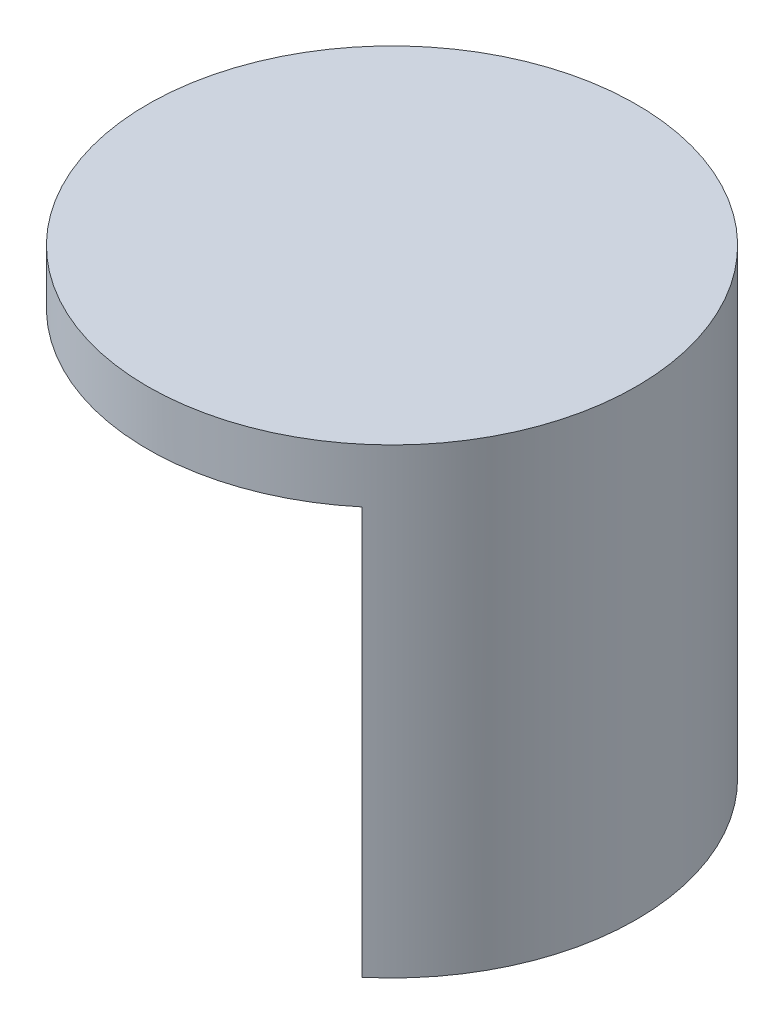
ISO-10303-21;
HEADER;
FILE_DESCRIPTION(('STEP AP214'),'2;1');
FILE_NAME('part.step','',(''),(''),'','','');
FILE_SCHEMA(('AUTOMOTIVE_DESIGN { 1 0 10303 214 1 1 1 1 }'));
ENDSEC;
DATA;
#1=APPLICATION_CONTEXT('core data for automotive mechanical design processes');
#2=APPLICATION_PROTOCOL_DEFINITION('international standard','automotive_design',2000,#1);
#3=PRODUCT_CONTEXT('',#1,'mechanical');
#4=PRODUCT('Part','Part','',(#3));
#5=PRODUCT_RELATED_PRODUCT_CATEGORY('part','',(#4));
#6=PRODUCT_DEFINITION_FORMATION('','',#4);
#7=PRODUCT_DEFINITION_CONTEXT('part definition',#1,'design');
#8=PRODUCT_DEFINITION('design','',#6,#7);
#9=PRODUCT_DEFINITION_SHAPE('','',#8);
#10=(LENGTH_UNIT() NAMED_UNIT(*) SI_UNIT(.MILLI.,.METRE.));
#11=(NAMED_UNIT(*) PLANE_ANGLE_UNIT() SI_UNIT($,.RADIAN.));
#12=(NAMED_UNIT(*) SI_UNIT($,.STERADIAN.) SOLID_ANGLE_UNIT());
#13=UNCERTAINTY_MEASURE_WITH_UNIT(LENGTH_MEASURE(1.E-05),#10,'distance_accuracy_value','');
#14=(GEOMETRIC_REPRESENTATION_CONTEXT(3) GLOBAL_UNCERTAINTY_ASSIGNED_CONTEXT((#13)) GLOBAL_UNIT_ASSIGNED_CONTEXT((#10,
#11,#12)) REPRESENTATION_CONTEXT('',''));
#15=CARTESIAN_POINT('',(0.,0.,0.));
#16=DIRECTION('',(0.,0.,1.));
#17=DIRECTION('',(1.,0.,0.));
#18=AXIS2_PLACEMENT_3D('',#15,#16,#17);
#19=CARTESIAN_POINT('',(0.,4.,0.));
#20=DIRECTION('',(0.,-1.,0.));
#21=DIRECTION('',(0.,0.,-1.));
#22=AXIS2_PLACEMENT_3D('',#19,#20,#21);
#23=CYLINDRICAL_SURFACE('',#22,18.);
#24=CARTESIAN_POINT('',(0.,4.,0.));
#25=DIRECTION('',(0.,1.,0.));
#26=DIRECTION('',(0.,0.,1.));
#27=AXIS2_PLACEMENT_3D('',#24,#25,#26);
#28=CIRCLE('',#27,18.);
#29=CARTESIAN_POINT('',(0.,4.,18.));
#30=VERTEX_POINT('',#29);
#31=EDGE_CURVE('E11',#30,#30,#28,.T.);
#32=ORIENTED_EDGE('',*,*,#31,.F.);
#33=EDGE_LOOP('',(#32));
#34=FACE_BOUND('',#33,.T.);
#35=CARTESIAN_POINT('',(0.,0.,0.));
#36=DIRECTION('',(0.,1.,0.));
#37=DIRECTION('',(0.,0.,1.));
#38=AXIS2_PLACEMENT_3D('',#35,#36,#37);
#39=CIRCLE('',#38,18.);
#40=CARTESIAN_POINT('',(11.5701769743577,0.,-13.7887999761416));
#41=VERTEX_POINT('',#40);
#42=CARTESIAN_POINT('',(11.5701769743577,0.,13.7887999761416));
#43=VERTEX_POINT('',#42);
#44=EDGE_CURVE('E40',#41,#43,#39,.T.);
#45=ORIENTED_EDGE('',*,*,#44,.T.);
#46=DIRECTION('',(0.,1.,0.));
#47=VECTOR('',#46,1.);
#48=CARTESIAN_POINT('',(11.5701769743577,-30.,13.7887999761416));
#49=LINE('',#48,#47);
#50=CARTESIAN_POINT('',(11.5701769743577,-30.,13.7887999761416));
#51=VERTEX_POINT('',#50);
#52=EDGE_CURVE('E105',#51,#43,#49,.T.);
#53=ORIENTED_EDGE('',*,*,#52,.F.);
#54=CARTESIAN_POINT('',(0.,-30.,0.));
#55=DIRECTION('',(0.,-1.,0.));
#56=DIRECTION('',(0.,0.,-1.));
#57=AXIS2_PLACEMENT_3D('',#54,#55,#56);
#58=CIRCLE('',#57,18.);
#59=CARTESIAN_POINT('',(11.5701769743577,-30.,-13.7887999761416));
#60=VERTEX_POINT('',#59);
#61=EDGE_CURVE('E90',#60,#51,#58,.T.);
#62=ORIENTED_EDGE('',*,*,#61,.F.);
#63=DIRECTION('',(0.,1.,0.));
#64=VECTOR('',#63,1.);
#65=CARTESIAN_POINT('',(11.5701769743577,-30.,-13.7887999761416));
#66=LINE('',#65,#64);
#67=EDGE_CURVE('E82',#60,#41,#66,.T.);
#68=ORIENTED_EDGE('',*,*,#67,.T.);
#69=EDGE_LOOP('',(#45,#53,#62,#68));
#70=FACE_BOUND('',#69,.T.);
#71=ADVANCED_FACE('F37',(#34,#70),#23,.T.);
#72=CARTESIAN_POINT('',(0.,4.,0.));
#73=DIRECTION('',(0.,1.,0.));
#74=DIRECTION('',(0.,0.,1.));
#75=AXIS2_PLACEMENT_3D('',#72,#73,#74);
#76=PLANE('',#75);
#77=ORIENTED_EDGE('',*,*,#31,.T.);
#78=EDGE_LOOP('',(#77));
#79=FACE_BOUND('',#78,.T.);
#80=ADVANCED_FACE('F116',(#79),#76,.T.);
#81=CARTESIAN_POINT('',(0.,0.,0.));
#82=DIRECTION('',(0.,1.,0.));
#83=DIRECTION('',(0.,0.,1.));
#84=AXIS2_PLACEMENT_3D('',#81,#82,#83);
#85=PLANE('',#84);
#86=CARTESIAN_POINT('',(0.,0.,0.));
#87=DIRECTION('',(0.,-1.,0.));
#88=DIRECTION('',(0.,0.,-1.));
#89=AXIS2_PLACEMENT_3D('',#86,#87,#88);
#90=CIRCLE('',#89,13.);
#91=CARTESIAN_POINT('',(8.35623892592499,0.,-9.95857776054673));
#92=VERTEX_POINT('',#91);
#93=CARTESIAN_POINT('',(8.35623892592499,0.,9.95857776054673));
#94=VERTEX_POINT('',#93);
#95=EDGE_CURVE('E51',#92,#94,#90,.T.);
#96=ORIENTED_EDGE('',*,*,#95,.T.);
#97=DIRECTION('',(0.642787609686538,0.,0.766044443118979));
#98=VECTOR('',#97,1.);
#99=CARTESIAN_POINT('',(0.,0.,0.));
#100=LINE('',#99,#98);
#101=EDGE_CURVE('E95',#94,#43,#100,.T.);
#102=ORIENTED_EDGE('',*,*,#101,.T.);
#103=ORIENTED_EDGE('',*,*,#44,.F.);
#104=DIRECTION('',(0.642787609686538,0.,-0.766044443118979));
#105=VECTOR('',#104,1.);
#106=CARTESIAN_POINT('',(0.,0.,0.));
#107=LINE('',#106,#105);
#108=EDGE_CURVE('E56',#92,#41,#107,.T.);
#109=ORIENTED_EDGE('',*,*,#108,.F.);
#110=EDGE_LOOP('',(#96,#102,#103,#109));
#111=FACE_BOUND('',#110,.T.);
#112=ADVANCED_FACE('F114',(#111),#85,.F.);
#113=CARTESIAN_POINT('',(0.,-30.,0.));
#114=DIRECTION('',(0.,1.,0.));
#115=DIRECTION('',(0.,0.,1.));
#116=AXIS2_PLACEMENT_3D('',#113,#114,#115);
#117=CYLINDRICAL_SURFACE('',#116,13.);
#118=ORIENTED_EDGE('',*,*,#95,.F.);
#119=DIRECTION('',(0.,1.,0.));
#120=VECTOR('',#119,1.);
#121=CARTESIAN_POINT('',(8.35623892592499,-30.,-9.95857776054673));
#122=LINE('',#121,#120);
#123=CARTESIAN_POINT('',(8.35623892592499,-30.,-9.95857776054673));
#124=VERTEX_POINT('',#123);
#125=EDGE_CURVE('E75',#124,#92,#122,.T.);
#126=ORIENTED_EDGE('',*,*,#125,.F.);
#127=CARTESIAN_POINT('',(0.,-30.,0.));
#128=DIRECTION('',(0.,-1.,0.));
#129=DIRECTION('',(0.,0.,-1.));
#130=AXIS2_PLACEMENT_3D('',#127,#128,#129);
#131=CIRCLE('',#130,13.);
#132=CARTESIAN_POINT('',(8.35623892592499,-30.,9.95857776054673));
#133=VERTEX_POINT('',#132);
#134=EDGE_CURVE('E79',#124,#133,#131,.T.);
#135=ORIENTED_EDGE('',*,*,#134,.T.);
#136=DIRECTION('',(0.,1.,0.));
#137=VECTOR('',#136,1.);
#138=CARTESIAN_POINT('',(8.35623892592499,-30.,9.95857776054673));
#139=LINE('',#138,#137);
#140=EDGE_CURVE('E101',#133,#94,#139,.T.);
#141=ORIENTED_EDGE('',*,*,#140,.T.);
#142=EDGE_LOOP('',(#118,#126,#135,#141));
#143=FACE_BOUND('',#142,.T.);
#144=ADVANCED_FACE('F77',(#143),#117,.F.);
#145=CARTESIAN_POINT('',(0.,-30.,0.));
#146=DIRECTION('',(0.766044443118979,0.,0.642787609686538));
#147=DIRECTION('',(0.642787609686538,0.,-0.766044443118979));
#148=AXIS2_PLACEMENT_3D('',#145,#146,#147);
#149=PLANE('',#148);
#150=ORIENTED_EDGE('',*,*,#108,.T.);
#151=ORIENTED_EDGE('',*,*,#67,.F.);
#152=DIRECTION('',(0.642787609686538,0.,-0.766044443118979));
#153=VECTOR('',#152,1.);
#154=CARTESIAN_POINT('',(0.,-30.,0.));
#155=LINE('',#154,#153);
#156=EDGE_CURVE('E85',#124,#60,#155,.T.);
#157=ORIENTED_EDGE('',*,*,#156,.F.);
#158=ORIENTED_EDGE('',*,*,#125,.T.);
#159=EDGE_LOOP('',(#150,#151,#157,#158));
#160=FACE_BOUND('',#159,.T.);
#161=ADVANCED_FACE('F86',(#160),#149,.F.);
#162=CARTESIAN_POINT('',(0.,-30.,0.));
#163=DIRECTION('',(-0.766044443118979,0.,0.642787609686538));
#164=DIRECTION('',(0.642787609686538,0.,0.766044443118979));
#165=AXIS2_PLACEMENT_3D('',#162,#163,#164);
#166=PLANE('',#165);
#167=ORIENTED_EDGE('',*,*,#101,.F.);
#168=ORIENTED_EDGE('',*,*,#140,.F.);
#169=DIRECTION('',(0.642787609686538,0.,0.766044443118979));
#170=VECTOR('',#169,1.);
#171=CARTESIAN_POINT('',(0.,-30.,0.));
#172=LINE('',#171,#170);
#173=EDGE_CURVE('E94',#133,#51,#172,.T.);
#174=ORIENTED_EDGE('',*,*,#173,.T.);
#175=ORIENTED_EDGE('',*,*,#52,.T.);
#176=EDGE_LOOP('',(#167,#168,#174,#175));
#177=FACE_BOUND('',#176,.T.);
#178=ADVANCED_FACE('F113',(#177),#166,.T.);
#179=CARTESIAN_POINT('',(0.,-30.,0.));
#180=DIRECTION('',(0.,-1.,0.));
#181=DIRECTION('',(0.,0.,-1.));
#182=AXIS2_PLACEMENT_3D('',#179,#180,#181);
#183=PLANE('',#182);
#184=ORIENTED_EDGE('',*,*,#134,.F.);
#185=ORIENTED_EDGE('',*,*,#156,.T.);
#186=ORIENTED_EDGE('',*,*,#61,.T.);
#187=ORIENTED_EDGE('',*,*,#173,.F.);
#188=EDGE_LOOP('',(#184,#185,#186,#187));
#189=FACE_BOUND('',#188,.T.);
#190=ADVANCED_FACE('F92',(#189),#183,.T.);
#191=CLOSED_SHELL('',(#71,#80,#112,#144,#161,#178,#190));
#192=MANIFOLD_SOLID_BREP('B2',#191);
#193=ADVANCED_BREP_SHAPE_REPRESENTATION('',(#18,#192),#14);
#194=SHAPE_DEFINITION_REPRESENTATION(#9,#193);
ENDSEC;
END-ISO-10303-21;
